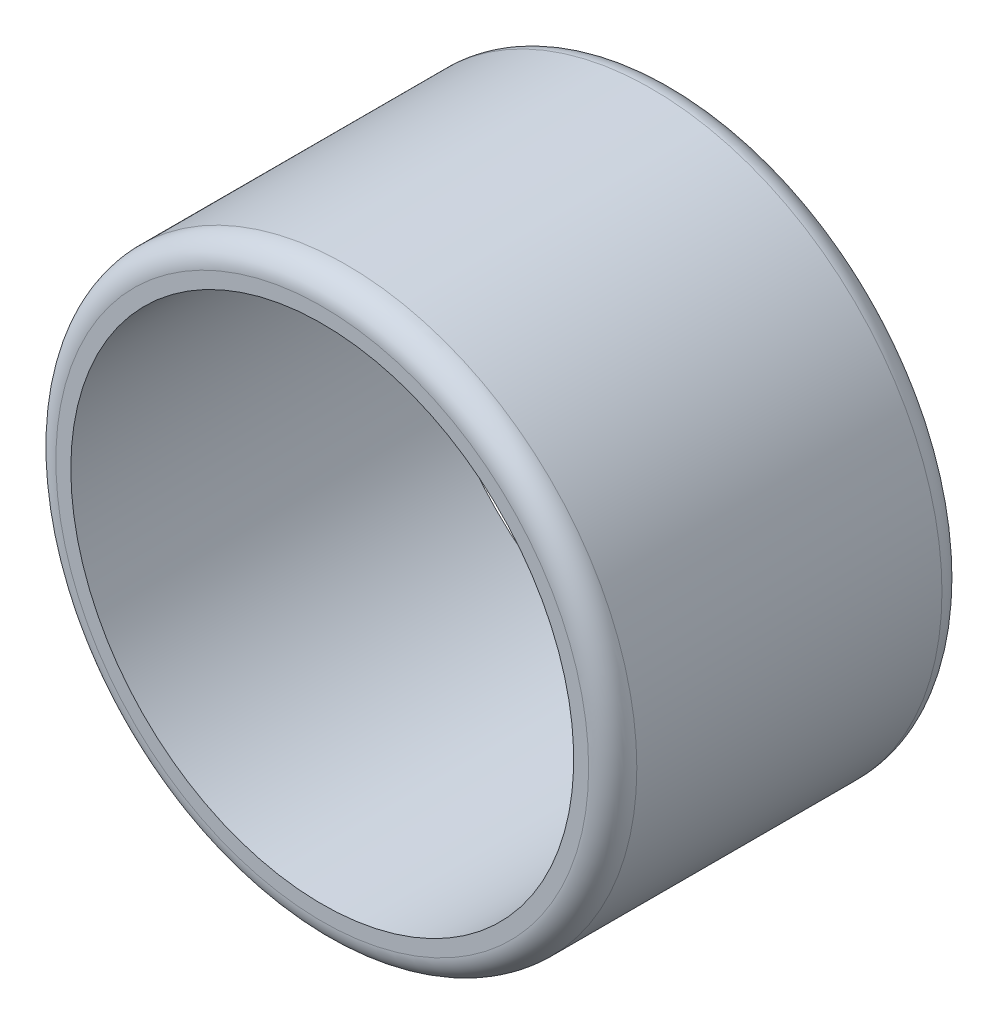
ISO-10303-21;
HEADER;
FILE_DESCRIPTION(('STEP AP214'),'2;1');
FILE_NAME('part.step','',(''),(''),'','','');
FILE_SCHEMA(('AUTOMOTIVE_DESIGN { 1 0 10303 214 1 1 1 1 }'));
ENDSEC;
DATA;
#1=APPLICATION_CONTEXT('core data for automotive mechanical design processes');
#2=APPLICATION_PROTOCOL_DEFINITION('international standard','automotive_design',2000,#1);
#3=PRODUCT_CONTEXT('',#1,'mechanical');
#4=PRODUCT('Part','Part','',(#3));
#5=PRODUCT_RELATED_PRODUCT_CATEGORY('part','',(#4));
#6=PRODUCT_DEFINITION_FORMATION('','',#4);
#7=PRODUCT_DEFINITION_CONTEXT('part definition',#1,'design');
#8=PRODUCT_DEFINITION('design','',#6,#7);
#9=PRODUCT_DEFINITION_SHAPE('','',#8);
#10=(LENGTH_UNIT() NAMED_UNIT(*) SI_UNIT(.MILLI.,.METRE.));
#11=(NAMED_UNIT(*) PLANE_ANGLE_UNIT() SI_UNIT($,.RADIAN.));
#12=(NAMED_UNIT(*) SI_UNIT($,.STERADIAN.) SOLID_ANGLE_UNIT());
#13=UNCERTAINTY_MEASURE_WITH_UNIT(LENGTH_MEASURE(1.E-05),#10,'distance_accuracy_value','');
#14=(GEOMETRIC_REPRESENTATION_CONTEXT(3) GLOBAL_UNCERTAINTY_ASSIGNED_CONTEXT((#13)) GLOBAL_UNIT_ASSIGNED_CONTEXT((#10,
#11,#12)) REPRESENTATION_CONTEXT('',''));
#15=CARTESIAN_POINT('',(0.,0.,0.));
#16=DIRECTION('',(0.,0.,1.));
#17=DIRECTION('',(1.,0.,0.));
#18=AXIS2_PLACEMENT_3D('',#15,#16,#17);
#19=CARTESIAN_POINT('',(2179.59090909091,2825.,58.1848110498031));
#20=DIRECTION('',(0.,0.,1.));
#21=DIRECTION('',(0.,-1.,0.));
#22=AXIS2_PLACEMENT_3D('',#19,#20,#21);
#23=CYLINDRICAL_SURFACE('',#22,904.406833613603);
#24=CARTESIAN_POINT('',(2179.59090909091,2825.,1083.1848110498));
#25=DIRECTION('',(0.,0.,1.));
#26=DIRECTION('',(1.,0.,0.));
#27=AXIS2_PLACEMENT_3D('',#24,#25,#26);
#28=CIRCLE('',#27,904.406833613603);
#29=CARTESIAN_POINT('',(3083.99774270451,2825.,1083.1848110498));
#30=VERTEX_POINT('',#29);
#31=EDGE_CURVE('E21',#30,#30,#28,.F.);
#32=ORIENTED_EDGE('',*,*,#31,.T.);
#33=EDGE_LOOP('',(#32));
#34=FACE_BOUND('',#33,.T.);
#35=CARTESIAN_POINT('',(2179.59090909091,2825.,133.184811049803));
#36=DIRECTION('',(0.,0.,1.));
#37=DIRECTION('',(1.,0.,0.));
#38=AXIS2_PLACEMENT_3D('',#35,#36,#37);
#39=CIRCLE('',#38,904.406833613603);
#40=CARTESIAN_POINT('',(3083.99774270451,2825.,133.184811049803));
#41=VERTEX_POINT('',#40);
#42=EDGE_CURVE('E25',#41,#41,#39,.T.);
#43=ORIENTED_EDGE('',*,*,#42,.T.);
#44=EDGE_LOOP('',(#43));
#45=FACE_BOUND('',#44,.T.);
#46=ADVANCED_FACE('F15',(#34,#45),#23,.T.);
#47=CARTESIAN_POINT('',(2179.59090909091,2825.,58.1848110498031));
#48=DIRECTION('',(0.,0.,1.));
#49=DIRECTION('',(0.,-1.,0.));
#50=AXIS2_PLACEMENT_3D('',#47,#48,#49);
#51=PLANE('',#50);
#52=CARTESIAN_POINT('',(2179.59090909091,2825.,58.1848110498031));
#53=DIRECTION('',(0.,0.,1.));
#54=DIRECTION('',(1.,0.,0.));
#55=AXIS2_PLACEMENT_3D('',#52,#53,#54);
#56=CIRCLE('',#55,829.406833613603);
#57=CARTESIAN_POINT('',(3008.99774270451,2825.,58.1848110498031));
#58=VERTEX_POINT('',#57);
#59=EDGE_CURVE('E10',#58,#58,#56,.F.);
#60=ORIENTED_EDGE('',*,*,#59,.T.);
#61=EDGE_LOOP('',(#60));
#62=FACE_BOUND('',#61,.T.);
#63=CARTESIAN_POINT('',(2179.59090909091,2825.,58.1848110498031));
#64=DIRECTION('',(0.,0.,-1.));
#65=DIRECTION('',(-1.,0.,0.));
#66=AXIS2_PLACEMENT_3D('',#63,#64,#65);
#67=CIRCLE('',#66,782.862069444271);
#68=CARTESIAN_POINT('',(1396.72883964664,2825.,58.1848110498031));
#69=VERTEX_POINT('',#68);
#70=EDGE_CURVE('E34',#69,#69,#67,.T.);
#71=ORIENTED_EDGE('',*,*,#70,.F.);
#72=EDGE_LOOP('',(#71));
#73=FACE_BOUND('',#72,.T.);
#74=ADVANCED_FACE('F43',(#62,#73),#51,.F.);
#75=CARTESIAN_POINT('',(2179.59090909091,2825.,1158.1848110498));
#76=DIRECTION('',(0.,0.,1.));
#77=DIRECTION('',(0.,-1.,0.));
#78=AXIS2_PLACEMENT_3D('',#75,#76,#77);
#79=PLANE('',#78);
#80=CARTESIAN_POINT('',(2179.59090909091,2825.,1158.1848110498));
#81=DIRECTION('',(0.,0.,1.));
#82=DIRECTION('',(1.,0.,0.));
#83=AXIS2_PLACEMENT_3D('',#80,#81,#82);
#84=CIRCLE('',#83,829.406833613603);
#85=CARTESIAN_POINT('',(3008.99774270451,2825.,1158.1848110498));
#86=VERTEX_POINT('',#85);
#87=EDGE_CURVE('E29',#86,#86,#84,.T.);
#88=ORIENTED_EDGE('',*,*,#87,.T.);
#89=EDGE_LOOP('',(#88));
#90=FACE_BOUND('',#89,.T.);
#91=CARTESIAN_POINT('',(2179.59090909091,2825.,1158.1848110498));
#92=DIRECTION('',(0.,0.,-1.));
#93=DIRECTION('',(-1.,0.,0.));
#94=AXIS2_PLACEMENT_3D('',#91,#92,#93);
#95=CIRCLE('',#94,782.862069444271);
#96=CARTESIAN_POINT('',(1396.72883964664,2825.,1158.1848110498));
#97=VERTEX_POINT('',#96);
#98=EDGE_CURVE('E35',#97,#97,#95,.T.);
#99=ORIENTED_EDGE('',*,*,#98,.T.);
#100=EDGE_LOOP('',(#99));
#101=FACE_BOUND('',#100,.T.);
#102=ADVANCED_FACE('F45',(#90,#101),#79,.T.);
#103=CARTESIAN_POINT('',(2179.59090909091,2825.,-141.815188950197));
#104=DIRECTION('',(0.,0.,1.));
#105=DIRECTION('',(-1.,0.,0.));
#106=AXIS2_PLACEMENT_3D('',#103,#104,#105);
#107=CYLINDRICAL_SURFACE('',#106,782.862069444271);
#108=ORIENTED_EDGE('',*,*,#98,.F.);
#109=EDGE_LOOP('',(#108));
#110=FACE_BOUND('',#109,.T.);
#111=ORIENTED_EDGE('',*,*,#70,.T.);
#112=EDGE_LOOP('',(#111));
#113=FACE_BOUND('',#112,.T.);
#114=ADVANCED_FACE('F41',(#110,#113),#107,.F.);
#115=CARTESIAN_POINT('',(2179.59090909091,2825.,1083.1848110498));
#116=DIRECTION('',(0.,0.,1.));
#117=DIRECTION('',(1.,0.,0.));
#118=AXIS2_PLACEMENT_3D('',#115,#116,#117);
#119=TOROIDAL_SURFACE('',#118,829.406833613603,75.);
#120=ORIENTED_EDGE('',*,*,#31,.F.);
#121=EDGE_LOOP('',(#120));
#122=FACE_BOUND('',#121,.T.);
#123=ORIENTED_EDGE('',*,*,#87,.F.);
#124=EDGE_LOOP('',(#123));
#125=FACE_BOUND('',#124,.T.);
#126=ADVANCED_FACE('F56',(#122,#125),#119,.T.);
#127=CARTESIAN_POINT('',(2179.59090909091,2825.,133.184811049803));
#128=DIRECTION('',(0.,0.,1.));
#129=DIRECTION('',(1.,0.,0.));
#130=AXIS2_PLACEMENT_3D('',#127,#128,#129);
#131=TOROIDAL_SURFACE('',#130,829.406833613603,75.);
#132=ORIENTED_EDGE('',*,*,#59,.F.);
#133=EDGE_LOOP('',(#132));
#134=FACE_BOUND('',#133,.T.);
#135=ORIENTED_EDGE('',*,*,#42,.F.);
#136=EDGE_LOOP('',(#135));
#137=FACE_BOUND('',#136,.T.);
#138=ADVANCED_FACE('F60',(#134,#137),#131,.T.);
#139=CLOSED_SHELL('',(#46,#74,#102,#114,#126,#138));
#140=MANIFOLD_SOLID_BREP('B1',#139);
#141=ADVANCED_BREP_SHAPE_REPRESENTATION('',(#18,#140),#14);
#142=SHAPE_DEFINITION_REPRESENTATION(#9,#141);
ENDSEC;
END-ISO-10303-21;
